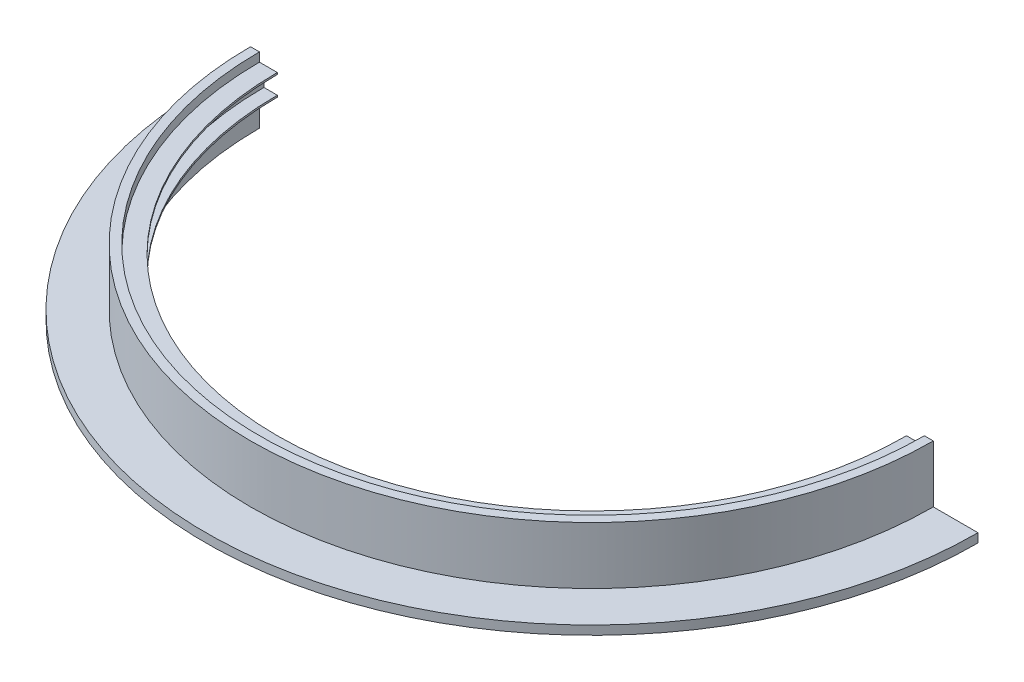
ISO-10303-21;
HEADER;
FILE_DESCRIPTION(('STEP AP214'),'2;1');
FILE_NAME('part.step','',(''),(''),'','','');
FILE_SCHEMA(('AUTOMOTIVE_DESIGN { 1 0 10303 214 1 1 1 1 }'));
ENDSEC;
DATA;
#1=APPLICATION_CONTEXT('core data for automotive mechanical design processes');
#2=APPLICATION_PROTOCOL_DEFINITION('international standard','automotive_design',2000,#1);
#3=PRODUCT_CONTEXT('',#1,'mechanical');
#4=PRODUCT('Part','Part','',(#3));
#5=PRODUCT_RELATED_PRODUCT_CATEGORY('part','',(#4));
#6=PRODUCT_DEFINITION_FORMATION('','',#4);
#7=PRODUCT_DEFINITION_CONTEXT('part definition',#1,'design');
#8=PRODUCT_DEFINITION('design','',#6,#7);
#9=PRODUCT_DEFINITION_SHAPE('','',#8);
#10=(LENGTH_UNIT() NAMED_UNIT(*) SI_UNIT(.MILLI.,.METRE.));
#11=(NAMED_UNIT(*) PLANE_ANGLE_UNIT() SI_UNIT($,.RADIAN.));
#12=(NAMED_UNIT(*) SI_UNIT($,.STERADIAN.) SOLID_ANGLE_UNIT());
#13=UNCERTAINTY_MEASURE_WITH_UNIT(LENGTH_MEASURE(1.E-05),#10,'distance_accuracy_value','');
#14=(GEOMETRIC_REPRESENTATION_CONTEXT(3) GLOBAL_UNCERTAINTY_ASSIGNED_CONTEXT((#13)) GLOBAL_UNIT_ASSIGNED_CONTEXT((#10,
#11,#12)) REPRESENTATION_CONTEXT('',''));
#15=CARTESIAN_POINT('',(0.,0.,0.));
#16=DIRECTION('',(0.,0.,1.));
#17=DIRECTION('',(1.,0.,0.));
#18=AXIS2_PLACEMENT_3D('',#15,#16,#17);
#19=CARTESIAN_POINT('',(485.3432,93.98,1.1371157906073E-12));
#20=DIRECTION('',(0.,1.,0.));
#21=DIRECTION('',(0.,0.,1.));
#22=AXIS2_PLACEMENT_3D('',#19,#20,#21);
#23=PLANE('',#22);
#24=CARTESIAN_POINT('',(0.,93.98,0.));
#25=DIRECTION('',(0.,-1.,0.));
#26=DIRECTION('',(0.,0.,-1.));
#27=AXIS2_PLACEMENT_3D('',#24,#25,#26);
#28=CIRCLE('',#27,472.6432);
#29=CARTESIAN_POINT('',(472.6432,93.98,1.1073608243469E-12));
#30=VERTEX_POINT('',#29);
#31=CARTESIAN_POINT('',(-472.6432,93.98,0.));
#32=VERTEX_POINT('',#31);
#33=EDGE_CURVE('E11',#30,#32,#28,.T.);
#34=ORIENTED_EDGE('',*,*,#33,.T.);
#35=DIRECTION('',(1.,0.,0.));
#36=VECTOR('',#35,1.);
#37=CARTESIAN_POINT('',(-485.3432,93.98,0.));
#38=LINE('',#37,#36);
#39=CARTESIAN_POINT('',(-485.3432,93.98,0.));
#40=VERTEX_POINT('',#39);
#41=EDGE_CURVE('E175',#40,#32,#38,.T.);
#42=ORIENTED_EDGE('',*,*,#41,.F.);
#43=CARTESIAN_POINT('',(0.,93.98,0.));
#44=DIRECTION('',(0.,-1.,0.));
#45=DIRECTION('',(0.,0.,-1.));
#46=AXIS2_PLACEMENT_3D('',#43,#44,#45);
#47=CIRCLE('',#46,485.3432);
#48=CARTESIAN_POINT('',(485.3432,93.98,1.1371157906073E-12));
#49=VERTEX_POINT('',#48);
#50=EDGE_CURVE('E126',#49,#40,#47,.T.);
#51=ORIENTED_EDGE('',*,*,#50,.F.);
#52=DIRECTION('',(-1.,0.,0.));
#53=VECTOR('',#52,1.);
#54=CARTESIAN_POINT('',(485.3432,93.98,1.1371157906073E-12));
#55=LINE('',#54,#53);
#56=EDGE_CURVE('E140',#49,#30,#55,.T.);
#57=ORIENTED_EDGE('',*,*,#56,.T.);
#58=EDGE_LOOP('',(#34,#42,#51,#57));
#59=FACE_BOUND('',#58,.T.);
#60=ADVANCED_FACE('F16',(#59),#23,.T.);
#61=CARTESIAN_POINT('',(0.,-43.6509429962423,0.));
#62=DIRECTION('',(0.,-1.,0.));
#63=DIRECTION('',(0.,0.,-1.));
#64=AXIS2_PLACEMENT_3D('',#61,#62,#63);
#65=CYLINDRICAL_SURFACE('',#64,472.6432);
#66=CARTESIAN_POINT('',(0.,81.28,0.));
#67=DIRECTION('',(0.,-1.,0.));
#68=DIRECTION('',(0.,0.,-1.));
#69=AXIS2_PLACEMENT_3D('',#66,#67,#68);
#70=CIRCLE('',#69,472.6432);
#71=CARTESIAN_POINT('',(472.6432,81.28,1.1073608243469E-12));
#72=VERTEX_POINT('',#71);
#73=CARTESIAN_POINT('',(-472.6432,81.28,0.));
#74=VERTEX_POINT('',#73);
#75=EDGE_CURVE('E24',#72,#74,#70,.T.);
#76=ORIENTED_EDGE('',*,*,#75,.T.);
#77=DIRECTION('',(0.,-1.,0.));
#78=VECTOR('',#77,1.);
#79=CARTESIAN_POINT('',(-472.6432,93.98,0.));
#80=LINE('',#79,#78);
#81=EDGE_CURVE('E172',#32,#74,#80,.T.);
#82=ORIENTED_EDGE('',*,*,#81,.F.);
#83=ORIENTED_EDGE('',*,*,#33,.F.);
#84=DIRECTION('',(0.,-1.,0.));
#85=VECTOR('',#84,1.);
#86=CARTESIAN_POINT('',(472.6432,93.98,1.1073608243469E-12));
#87=LINE('',#86,#85);
#88=EDGE_CURVE('E142',#30,#72,#87,.T.);
#89=ORIENTED_EDGE('',*,*,#88,.T.);
#90=EDGE_LOOP('',(#76,#82,#83,#89));
#91=FACE_BOUND('',#90,.T.);
#92=ADVANCED_FACE('F18',(#91),#65,.F.);
#93=CARTESIAN_POINT('',(472.6432,81.28,1.1073608243469E-12));
#94=DIRECTION('',(0.,1.,0.));
#95=DIRECTION('',(0.,0.,1.));
#96=AXIS2_PLACEMENT_3D('',#93,#94,#95);
#97=PLANE('',#96);
#98=CARTESIAN_POINT('',(0.,81.28,0.));
#99=DIRECTION('',(0.,-1.,0.));
#100=DIRECTION('',(0.,0.,-1.));
#101=AXIS2_PLACEMENT_3D('',#98,#99,#100);
#102=CIRCLE('',#101,447.2432);
#103=CARTESIAN_POINT('',(447.2432,81.28,1.04785089182611E-12));
#104=VERTEX_POINT('',#103);
#105=CARTESIAN_POINT('',(-447.2432,81.28,0.));
#106=VERTEX_POINT('',#105);
#107=EDGE_CURVE('E228',#104,#106,#102,.T.);
#108=ORIENTED_EDGE('',*,*,#107,.T.);
#109=DIRECTION('',(1.,0.,0.));
#110=VECTOR('',#109,1.);
#111=CARTESIAN_POINT('',(-472.6432,81.28,0.));
#112=LINE('',#111,#110);
#113=EDGE_CURVE('E169',#74,#106,#112,.T.);
#114=ORIENTED_EDGE('',*,*,#113,.F.);
#115=ORIENTED_EDGE('',*,*,#75,.F.);
#116=DIRECTION('',(-1.,0.,0.));
#117=VECTOR('',#116,1.);
#118=CARTESIAN_POINT('',(472.6432,81.28,1.1073608243469E-12));
#119=LINE('',#118,#117);
#120=EDGE_CURVE('E207',#72,#104,#119,.T.);
#121=ORIENTED_EDGE('',*,*,#120,.T.);
#122=EDGE_LOOP('',(#108,#114,#115,#121));
#123=FACE_BOUND('',#122,.T.);
#124=ADVANCED_FACE('F232',(#123),#97,.T.);
#125=CARTESIAN_POINT('',(0.,-43.6509429962423,0.));
#126=DIRECTION('',(0.,-1.,0.));
#127=DIRECTION('',(0.,0.,-1.));
#128=AXIS2_PLACEMENT_3D('',#125,#126,#127);
#129=CYLINDRICAL_SURFACE('',#128,447.2432);
#130=CARTESIAN_POINT('',(0.,78.74,0.));
#131=DIRECTION('',(0.,-1.,0.));
#132=DIRECTION('',(0.,0.,-1.));
#133=AXIS2_PLACEMENT_3D('',#130,#131,#132);
#134=CIRCLE('',#133,447.2432);
#135=CARTESIAN_POINT('',(447.2432,78.74,1.04785089182611E-12));
#136=VERTEX_POINT('',#135);
#137=CARTESIAN_POINT('',(-447.2432,78.74,0.));
#138=VERTEX_POINT('',#137);
#139=EDGE_CURVE('E226',#136,#138,#134,.T.);
#140=ORIENTED_EDGE('',*,*,#139,.T.);
#141=DIRECTION('',(0.,-1.,0.));
#142=VECTOR('',#141,1.);
#143=CARTESIAN_POINT('',(-447.2432,81.28,0.));
#144=LINE('',#143,#142);
#145=EDGE_CURVE('E166',#106,#138,#144,.T.);
#146=ORIENTED_EDGE('',*,*,#145,.F.);
#147=ORIENTED_EDGE('',*,*,#107,.F.);
#148=DIRECTION('',(0.,-1.,0.));
#149=VECTOR('',#148,1.);
#150=CARTESIAN_POINT('',(447.2432,81.28,1.04785089182611E-12));
#151=LINE('',#150,#149);
#152=EDGE_CURVE('E204',#104,#136,#151,.T.);
#153=ORIENTED_EDGE('',*,*,#152,.T.);
#154=EDGE_LOOP('',(#140,#146,#147,#153));
#155=FACE_BOUND('',#154,.T.);
#156=ADVANCED_FACE('F235',(#155),#129,.F.);
#157=CARTESIAN_POINT('',(447.2432,78.74,1.04785089182611E-12));
#158=DIRECTION('',(0.,-1.,0.));
#159=DIRECTION('',(0.,0.,-1.));
#160=AXIS2_PLACEMENT_3D('',#157,#158,#159);
#161=PLANE('',#160);
#162=CARTESIAN_POINT('',(0.,78.74,0.));
#163=DIRECTION('',(0.,-1.,0.));
#164=DIRECTION('',(0.,0.,-1.));
#165=AXIS2_PLACEMENT_3D('',#162,#163,#164);
#166=CIRCLE('',#165,466.2932);
#167=CARTESIAN_POINT('',(466.2932,78.74,1.0924833412167E-12));
#168=VERTEX_POINT('',#167);
#169=CARTESIAN_POINT('',(-466.2932,78.74,0.));
#170=VERTEX_POINT('',#169);
#171=EDGE_CURVE('E224',#168,#170,#166,.T.);
#172=ORIENTED_EDGE('',*,*,#171,.T.);
#173=DIRECTION('',(-1.,0.,0.));
#174=VECTOR('',#173,1.);
#175=CARTESIAN_POINT('',(-447.2432,78.74,0.));
#176=LINE('',#175,#174);
#177=EDGE_CURVE('E163',#138,#170,#176,.T.);
#178=ORIENTED_EDGE('',*,*,#177,.F.);
#179=ORIENTED_EDGE('',*,*,#139,.F.);
#180=DIRECTION('',(1.,0.,0.));
#181=VECTOR('',#180,1.);
#182=CARTESIAN_POINT('',(447.2432,78.74,1.04785089182611E-12));
#183=LINE('',#182,#181);
#184=EDGE_CURVE('E201',#136,#168,#183,.T.);
#185=ORIENTED_EDGE('',*,*,#184,.T.);
#186=EDGE_LOOP('',(#172,#178,#179,#185));
#187=FACE_BOUND('',#186,.T.);
#188=ADVANCED_FACE('F240',(#187),#161,.T.);
#189=CARTESIAN_POINT('',(0.,-43.6509429962423,0.));
#190=DIRECTION('',(0.,-1.,0.));
#191=DIRECTION('',(0.,0.,-1.));
#192=AXIS2_PLACEMENT_3D('',#189,#190,#191);
#193=CYLINDRICAL_SURFACE('',#192,466.2932);
#194=CARTESIAN_POINT('',(0.,53.34,0.));
#195=DIRECTION('',(0.,-1.,0.));
#196=DIRECTION('',(0.,0.,-1.));
#197=AXIS2_PLACEMENT_3D('',#194,#195,#196);
#198=CIRCLE('',#197,466.2932);
#199=CARTESIAN_POINT('',(466.2932,53.34,1.0924833412167E-12));
#200=VERTEX_POINT('',#199);
#201=CARTESIAN_POINT('',(-466.2932,53.34,0.));
#202=VERTEX_POINT('',#201);
#203=EDGE_CURVE('E222',#200,#202,#198,.T.);
#204=ORIENTED_EDGE('',*,*,#203,.T.);
#205=DIRECTION('',(0.,-1.,0.));
#206=VECTOR('',#205,1.);
#207=CARTESIAN_POINT('',(-466.2932,78.74,0.));
#208=LINE('',#207,#206);
#209=EDGE_CURVE('E160',#170,#202,#208,.T.);
#210=ORIENTED_EDGE('',*,*,#209,.F.);
#211=ORIENTED_EDGE('',*,*,#171,.F.);
#212=DIRECTION('',(0.,-1.,0.));
#213=VECTOR('',#212,1.);
#214=CARTESIAN_POINT('',(466.2932,78.74,1.0924833412167E-12));
#215=LINE('',#214,#213);
#216=EDGE_CURVE('E198',#168,#200,#215,.T.);
#217=ORIENTED_EDGE('',*,*,#216,.T.);
#218=EDGE_LOOP('',(#204,#210,#211,#217));
#219=FACE_BOUND('',#218,.T.);
#220=ADVANCED_FACE('F243',(#219),#193,.F.);
#221=CARTESIAN_POINT('',(466.2932,53.34,1.0924833412167E-12));
#222=DIRECTION('',(0.,1.,0.));
#223=DIRECTION('',(0.,0.,1.));
#224=AXIS2_PLACEMENT_3D('',#221,#222,#223);
#225=PLANE('',#224);
#226=CARTESIAN_POINT('',(0.,53.34,0.));
#227=DIRECTION('',(0.,-1.,0.));
#228=DIRECTION('',(0.,0.,-1.));
#229=AXIS2_PLACEMENT_3D('',#226,#227,#228);
#230=CIRCLE('',#229,447.2432);
#231=CARTESIAN_POINT('',(447.2432,53.34,1.04785089182611E-12));
#232=VERTEX_POINT('',#231);
#233=CARTESIAN_POINT('',(-447.2432,53.34,0.));
#234=VERTEX_POINT('',#233);
#235=EDGE_CURVE('E220',#232,#234,#230,.T.);
#236=ORIENTED_EDGE('',*,*,#235,.T.);
#237=DIRECTION('',(1.,0.,0.));
#238=VECTOR('',#237,1.);
#239=CARTESIAN_POINT('',(-466.2932,53.34,0.));
#240=LINE('',#239,#238);
#241=EDGE_CURVE('E157',#202,#234,#240,.T.);
#242=ORIENTED_EDGE('',*,*,#241,.F.);
#243=ORIENTED_EDGE('',*,*,#203,.F.);
#244=DIRECTION('',(-1.,0.,0.));
#245=VECTOR('',#244,1.);
#246=CARTESIAN_POINT('',(466.2932,53.34,1.0924833412167E-12));
#247=LINE('',#246,#245);
#248=EDGE_CURVE('E195',#200,#232,#247,.T.);
#249=ORIENTED_EDGE('',*,*,#248,.T.);
#250=EDGE_LOOP('',(#236,#242,#243,#249));
#251=FACE_BOUND('',#250,.T.);
#252=ADVANCED_FACE('F248',(#251),#225,.T.);
#253=CARTESIAN_POINT('',(0.,-43.6509429962423,0.));
#254=DIRECTION('',(0.,-1.,0.));
#255=DIRECTION('',(0.,0.,-1.));
#256=AXIS2_PLACEMENT_3D('',#253,#254,#255);
#257=CYLINDRICAL_SURFACE('',#256,447.2432);
#258=CARTESIAN_POINT('',(0.,50.8,0.));
#259=DIRECTION('',(0.,-1.,0.));
#260=DIRECTION('',(0.,0.,-1.));
#261=AXIS2_PLACEMENT_3D('',#258,#259,#260);
#262=CIRCLE('',#261,447.2432);
#263=CARTESIAN_POINT('',(447.2432,50.8,1.04785089182611E-12));
#264=VERTEX_POINT('',#263);
#265=CARTESIAN_POINT('',(-447.2432,50.8,0.));
#266=VERTEX_POINT('',#265);
#267=EDGE_CURVE('E218',#264,#266,#262,.T.);
#268=ORIENTED_EDGE('',*,*,#267,.T.);
#269=DIRECTION('',(0.,-1.,0.));
#270=VECTOR('',#269,1.);
#271=CARTESIAN_POINT('',(-447.2432,53.34,0.));
#272=LINE('',#271,#270);
#273=EDGE_CURVE('E154',#234,#266,#272,.T.);
#274=ORIENTED_EDGE('',*,*,#273,.F.);
#275=ORIENTED_EDGE('',*,*,#235,.F.);
#276=DIRECTION('',(0.,-1.,0.));
#277=VECTOR('',#276,1.);
#278=CARTESIAN_POINT('',(447.2432,53.34,1.04785089182611E-12));
#279=LINE('',#278,#277);
#280=EDGE_CURVE('E192',#232,#264,#279,.T.);
#281=ORIENTED_EDGE('',*,*,#280,.T.);
#282=EDGE_LOOP('',(#268,#274,#275,#281));
#283=FACE_BOUND('',#282,.T.);
#284=ADVANCED_FACE('F251',(#283),#257,.F.);
#285=CARTESIAN_POINT('',(447.2432,50.8,1.04785089182611E-12));
#286=DIRECTION('',(0.,-1.,0.));
#287=DIRECTION('',(0.,0.,-1.));
#288=AXIS2_PLACEMENT_3D('',#285,#286,#287);
#289=PLANE('',#288);
#290=CARTESIAN_POINT('',(0.,50.8,0.));
#291=DIRECTION('',(0.,-1.,0.));
#292=DIRECTION('',(0.,0.,-1.));
#293=AXIS2_PLACEMENT_3D('',#290,#291,#292);
#294=CIRCLE('',#293,472.6432);
#295=CARTESIAN_POINT('',(472.6432,50.8,1.1073608243469E-12));
#296=VERTEX_POINT('',#295);
#297=CARTESIAN_POINT('',(-472.6432,50.8,0.));
#298=VERTEX_POINT('',#297);
#299=EDGE_CURVE('E216',#296,#298,#294,.T.);
#300=ORIENTED_EDGE('',*,*,#299,.T.);
#301=DIRECTION('',(-1.,0.,0.));
#302=VECTOR('',#301,1.);
#303=CARTESIAN_POINT('',(-447.2432,50.8,0.));
#304=LINE('',#303,#302);
#305=EDGE_CURVE('E151',#266,#298,#304,.T.);
#306=ORIENTED_EDGE('',*,*,#305,.F.);
#307=ORIENTED_EDGE('',*,*,#267,.F.);
#308=DIRECTION('',(1.,0.,0.));
#309=VECTOR('',#308,1.);
#310=CARTESIAN_POINT('',(447.2432,50.8,1.04785089182611E-12));
#311=LINE('',#310,#309);
#312=EDGE_CURVE('E189',#264,#296,#311,.T.);
#313=ORIENTED_EDGE('',*,*,#312,.T.);
#314=EDGE_LOOP('',(#300,#306,#307,#313));
#315=FACE_BOUND('',#314,.T.);
#316=ADVANCED_FACE('F256',(#315),#289,.T.);
#317=CARTESIAN_POINT('',(0.,-43.6509429962423,0.));
#318=DIRECTION('',(0.,-1.,0.));
#319=DIRECTION('',(0.,0.,-1.));
#320=AXIS2_PLACEMENT_3D('',#317,#318,#319);
#321=CYLINDRICAL_SURFACE('',#320,472.6432);
#322=CARTESIAN_POINT('',(0.,0.,0.));
#323=DIRECTION('',(0.,-1.,0.));
#324=DIRECTION('',(0.,0.,-1.));
#325=AXIS2_PLACEMENT_3D('',#322,#323,#324);
#326=CIRCLE('',#325,472.6432);
#327=CARTESIAN_POINT('',(472.6432,0.,1.1073608243469E-12));
#328=VERTEX_POINT('',#327);
#329=CARTESIAN_POINT('',(-472.6432,0.,0.));
#330=VERTEX_POINT('',#329);
#331=EDGE_CURVE('E214',#328,#330,#326,.T.);
#332=ORIENTED_EDGE('',*,*,#331,.T.);
#333=DIRECTION('',(0.,-1.,0.));
#334=VECTOR('',#333,1.);
#335=CARTESIAN_POINT('',(-472.6432,50.8,0.));
#336=LINE('',#335,#334);
#337=EDGE_CURVE('E148',#298,#330,#336,.T.);
#338=ORIENTED_EDGE('',*,*,#337,.F.);
#339=ORIENTED_EDGE('',*,*,#299,.F.);
#340=DIRECTION('',(0.,-1.,0.));
#341=VECTOR('',#340,1.);
#342=CARTESIAN_POINT('',(472.6432,50.8,1.1073608243469E-12));
#343=LINE('',#342,#341);
#344=EDGE_CURVE('E186',#296,#328,#343,.T.);
#345=ORIENTED_EDGE('',*,*,#344,.T.);
#346=EDGE_LOOP('',(#332,#338,#339,#345));
#347=FACE_BOUND('',#346,.T.);
#348=ADVANCED_FACE('F259',(#347),#321,.F.);
#349=CARTESIAN_POINT('',(472.6432,0.,1.1073608243469E-12));
#350=DIRECTION('',(0.,-1.,0.));
#351=DIRECTION('',(0.,0.,-1.));
#352=AXIS2_PLACEMENT_3D('',#349,#350,#351);
#353=PLANE('',#352);
#354=CARTESIAN_POINT('',(0.,0.,0.));
#355=DIRECTION('',(0.,-1.,0.));
#356=DIRECTION('',(0.,0.,-1.));
#357=AXIS2_PLACEMENT_3D('',#354,#355,#356);
#358=CIRCLE('',#357,548.8432);
#359=CARTESIAN_POINT('',(548.8432,0.,1.28589062190928E-12));
#360=VERTEX_POINT('',#359);
#361=CARTESIAN_POINT('',(-548.8432,0.,0.));
#362=VERTEX_POINT('',#361);
#363=EDGE_CURVE('E212',#360,#362,#358,.T.);
#364=ORIENTED_EDGE('',*,*,#363,.T.);
#365=DIRECTION('',(-1.,0.,0.));
#366=VECTOR('',#365,1.);
#367=CARTESIAN_POINT('',(-472.6432,0.,0.));
#368=LINE('',#367,#366);
#369=EDGE_CURVE('E146',#330,#362,#368,.T.);
#370=ORIENTED_EDGE('',*,*,#369,.F.);
#371=ORIENTED_EDGE('',*,*,#331,.F.);
#372=DIRECTION('',(1.,0.,0.));
#373=VECTOR('',#372,1.);
#374=CARTESIAN_POINT('',(472.6432,0.,1.1073608243469E-12));
#375=LINE('',#374,#373);
#376=EDGE_CURVE('E183',#328,#360,#375,.T.);
#377=ORIENTED_EDGE('',*,*,#376,.T.);
#378=EDGE_LOOP('',(#364,#370,#371,#377));
#379=FACE_BOUND('',#378,.T.);
#380=ADVANCED_FACE('F263',(#379),#353,.T.);
#381=CARTESIAN_POINT('',(0.,-43.6509429962423,0.));
#382=DIRECTION('',(0.,-1.,0.));
#383=DIRECTION('',(0.,0.,-1.));
#384=AXIS2_PLACEMENT_3D('',#381,#382,#383);
#385=CYLINDRICAL_SURFACE('',#384,548.8432);
#386=CARTESIAN_POINT('',(0.,12.7,0.));
#387=DIRECTION('',(0.,-1.,0.));
#388=DIRECTION('',(0.,0.,-1.));
#389=AXIS2_PLACEMENT_3D('',#386,#387,#388);
#390=CIRCLE('',#389,548.8432);
#391=CARTESIAN_POINT('',(548.8432,12.7,1.28589062190928E-12));
#392=VERTEX_POINT('',#391);
#393=CARTESIAN_POINT('',(-548.8432,12.7,0.));
#394=VERTEX_POINT('',#393);
#395=EDGE_CURVE('E125',#392,#394,#390,.T.);
#396=ORIENTED_EDGE('',*,*,#395,.T.);
#397=DIRECTION('',(0.,1.,0.));
#398=VECTOR('',#397,1.);
#399=CARTESIAN_POINT('',(-548.8432,0.,0.));
#400=LINE('',#399,#398);
#401=EDGE_CURVE('E136',#362,#394,#400,.T.);
#402=ORIENTED_EDGE('',*,*,#401,.F.);
#403=ORIENTED_EDGE('',*,*,#363,.F.);
#404=DIRECTION('',(0.,1.,0.));
#405=VECTOR('',#404,1.);
#406=CARTESIAN_POINT('',(548.8432,0.,1.28589062190928E-12));
#407=LINE('',#406,#405);
#408=EDGE_CURVE('E180',#360,#392,#407,.T.);
#409=ORIENTED_EDGE('',*,*,#408,.T.);
#410=EDGE_LOOP('',(#396,#402,#403,#409));
#411=FACE_BOUND('',#410,.T.);
#412=ADVANCED_FACE('F266',(#411),#385,.T.);
#413=CARTESIAN_POINT('',(548.8432,12.7,1.28589062190928E-12));
#414=DIRECTION('',(0.,1.,0.));
#415=DIRECTION('',(0.,0.,1.));
#416=AXIS2_PLACEMENT_3D('',#413,#414,#415);
#417=PLANE('',#416);
#418=CARTESIAN_POINT('',(0.,12.7,0.));
#419=DIRECTION('',(0.,-1.,0.));
#420=DIRECTION('',(0.,0.,-1.));
#421=AXIS2_PLACEMENT_3D('',#418,#419,#420);
#422=CIRCLE('',#421,485.3432);
#423=CARTESIAN_POINT('',(485.3432,12.7,1.1371157906073E-12));
#424=VERTEX_POINT('',#423);
#425=CARTESIAN_POINT('',(-485.3432,12.7,0.));
#426=VERTEX_POINT('',#425);
#427=EDGE_CURVE('E115',#424,#426,#422,.T.);
#428=ORIENTED_EDGE('',*,*,#427,.T.);
#429=DIRECTION('',(1.,0.,0.));
#430=VECTOR('',#429,1.);
#431=CARTESIAN_POINT('',(-548.8432,12.7,0.));
#432=LINE('',#431,#430);
#433=EDGE_CURVE('E118',#394,#426,#432,.T.);
#434=ORIENTED_EDGE('',*,*,#433,.F.);
#435=ORIENTED_EDGE('',*,*,#395,.F.);
#436=DIRECTION('',(-1.,0.,0.));
#437=VECTOR('',#436,1.);
#438=CARTESIAN_POINT('',(548.8432,12.7,1.28589062190928E-12));
#439=LINE('',#438,#437);
#440=EDGE_CURVE('E120',#392,#424,#439,.T.);
#441=ORIENTED_EDGE('',*,*,#440,.T.);
#442=EDGE_LOOP('',(#428,#434,#435,#441));
#443=FACE_BOUND('',#442,.T.);
#444=ADVANCED_FACE('F117',(#443),#417,.T.);
#445=CARTESIAN_POINT('',(0.,-43.6509429962423,0.));
#446=DIRECTION('',(0.,-1.,0.));
#447=DIRECTION('',(0.,0.,-1.));
#448=AXIS2_PLACEMENT_3D('',#445,#446,#447);
#449=CYLINDRICAL_SURFACE('',#448,485.3432);
#450=DIRECTION('',(0.,1.,0.));
#451=VECTOR('',#450,1.);
#452=CARTESIAN_POINT('',(485.3432,12.7,1.1371157906073E-12));
#453=LINE('',#452,#451);
#454=EDGE_CURVE('E177',#424,#49,#453,.T.);
#455=ORIENTED_EDGE('',*,*,#454,.T.);
#456=ORIENTED_EDGE('',*,*,#50,.T.);
#457=DIRECTION('',(0.,1.,0.));
#458=VECTOR('',#457,1.);
#459=CARTESIAN_POINT('',(-485.3432,12.7,0.));
#460=LINE('',#459,#458);
#461=EDGE_CURVE('E133',#426,#40,#460,.T.);
#462=ORIENTED_EDGE('',*,*,#461,.F.);
#463=ORIENTED_EDGE('',*,*,#427,.F.);
#464=EDGE_LOOP('',(#455,#456,#462,#463));
#465=FACE_BOUND('',#464,.T.);
#466=ADVANCED_FACE('F138',(#465),#449,.T.);
#467=CARTESIAN_POINT('',(472.6432,93.98,1.1073608243469E-12));
#468=DIRECTION('',(0.,0.,1.));
#469=DIRECTION('',(1.,0.,0.));
#470=AXIS2_PLACEMENT_3D('',#467,#468,#469);
#471=PLANE('',#470);
#472=ORIENTED_EDGE('',*,*,#56,.F.);
#473=ORIENTED_EDGE('',*,*,#454,.F.);
#474=ORIENTED_EDGE('',*,*,#440,.F.);
#475=ORIENTED_EDGE('',*,*,#408,.F.);
#476=ORIENTED_EDGE('',*,*,#376,.F.);
#477=ORIENTED_EDGE('',*,*,#344,.F.);
#478=ORIENTED_EDGE('',*,*,#312,.F.);
#479=ORIENTED_EDGE('',*,*,#280,.F.);
#480=ORIENTED_EDGE('',*,*,#248,.F.);
#481=ORIENTED_EDGE('',*,*,#216,.F.);
#482=ORIENTED_EDGE('',*,*,#184,.F.);
#483=ORIENTED_EDGE('',*,*,#152,.F.);
#484=ORIENTED_EDGE('',*,*,#120,.F.);
#485=ORIENTED_EDGE('',*,*,#88,.F.);
#486=EDGE_LOOP('',(#472,#473,#474,#475,#476,#477,#478,#479,#480,#481,#482,#483,#484,#485));
#487=FACE_BOUND('',#486,.T.);
#488=ADVANCED_FACE('F269',(#487),#471,.F.);
#489=CARTESIAN_POINT('',(-472.6432,93.98,0.));
#490=DIRECTION('',(0.,0.,-1.));
#491=DIRECTION('',(-1.,0.,0.));
#492=AXIS2_PLACEMENT_3D('',#489,#490,#491);
#493=PLANE('',#492);
#494=ORIENTED_EDGE('',*,*,#41,.T.);
#495=ORIENTED_EDGE('',*,*,#81,.T.);
#496=ORIENTED_EDGE('',*,*,#113,.T.);
#497=ORIENTED_EDGE('',*,*,#145,.T.);
#498=ORIENTED_EDGE('',*,*,#177,.T.);
#499=ORIENTED_EDGE('',*,*,#209,.T.);
#500=ORIENTED_EDGE('',*,*,#241,.T.);
#501=ORIENTED_EDGE('',*,*,#273,.T.);
#502=ORIENTED_EDGE('',*,*,#305,.T.);
#503=ORIENTED_EDGE('',*,*,#337,.T.);
#504=ORIENTED_EDGE('',*,*,#369,.T.);
#505=ORIENTED_EDGE('',*,*,#401,.T.);
#506=ORIENTED_EDGE('',*,*,#433,.T.);
#507=ORIENTED_EDGE('',*,*,#461,.T.);
#508=EDGE_LOOP('',(#494,#495,#496,#497,#498,#499,#500,#501,#502,#503,#504,#505,#506,#507));
#509=FACE_BOUND('',#508,.T.);
#510=ADVANCED_FACE('F132',(#509),#493,.T.);
#511=CLOSED_SHELL('',(#60,#92,#124,#156,#188,#220,#252,#284,#316,#348,#380,#412,#444,#466,#488,#510));
#512=MANIFOLD_SOLID_BREP('B1',#511);
#513=ADVANCED_BREP_SHAPE_REPRESENTATION('',(#18,#512),#14);
#514=SHAPE_DEFINITION_REPRESENTATION(#9,#513);
ENDSEC;
END-ISO-10303-21;
